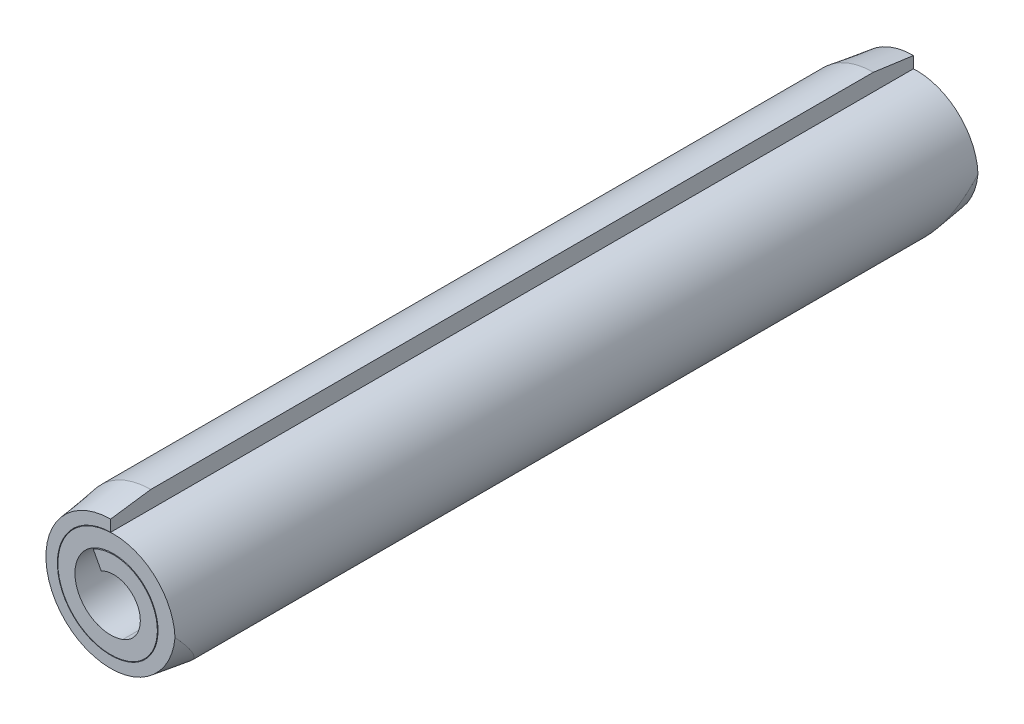
ISO-10303-21;
HEADER;
FILE_DESCRIPTION(('STEP AP214'),'2;1');
FILE_NAME('part.step','',(''),(''),'','','');
FILE_SCHEMA(('AUTOMOTIVE_DESIGN { 1 0 10303 214 1 1 1 1 }'));
ENDSEC;
DATA;
#1=APPLICATION_CONTEXT('core data for automotive mechanical design processes');
#2=APPLICATION_PROTOCOL_DEFINITION('international standard','automotive_design',2000,#1);
#3=PRODUCT_CONTEXT('',#1,'mechanical');
#4=PRODUCT('Part','Part','',(#3));
#5=PRODUCT_RELATED_PRODUCT_CATEGORY('part','',(#4));
#6=PRODUCT_DEFINITION_FORMATION('','',#4);
#7=PRODUCT_DEFINITION_CONTEXT('part definition',#1,'design');
#8=PRODUCT_DEFINITION('design','',#6,#7);
#9=PRODUCT_DEFINITION_SHAPE('','',#8);
#10=(LENGTH_UNIT() NAMED_UNIT(*) SI_UNIT(.MILLI.,.METRE.));
#11=(NAMED_UNIT(*) PLANE_ANGLE_UNIT() SI_UNIT($,.RADIAN.));
#12=(NAMED_UNIT(*) SI_UNIT($,.STERADIAN.) SOLID_ANGLE_UNIT());
#13=UNCERTAINTY_MEASURE_WITH_UNIT(LENGTH_MEASURE(1.E-05),#10,'distance_accuracy_value','');
#14=(GEOMETRIC_REPRESENTATION_CONTEXT(3) GLOBAL_UNCERTAINTY_ASSIGNED_CONTEXT((#13)) GLOBAL_UNIT_ASSIGNED_CONTEXT((#10,
#11,#12)) REPRESENTATION_CONTEXT('',''));
#15=CARTESIAN_POINT('',(0.,0.,0.));
#16=DIRECTION('',(0.,0.,1.));
#17=DIRECTION('',(1.,0.,0.));
#18=AXIS2_PLACEMENT_3D('',#15,#16,#17);
#19=CARTESIAN_POINT('',(-0.211085830625034,0.338291437783564,-9.));
#20=DIRECTION('',(0.883353817881994,0.468706765935062,0.));
#21=DIRECTION('',(-0.468706765935062,0.883353817881994,0.));
#22=AXIS2_PLACEMENT_3D('',#19,#20,#21);
#23=PLANE('',#22);
#24=DIRECTION('',(0.,0.,1.));
#25=VECTOR('',#24,1.);
#26=CARTESIAN_POINT('',(-0.390102521039357,0.675677386600868,-9.));
#27=LINE('',#26,#25);
#28=CARTESIAN_POINT('',(-0.390102521039357,0.675677386600868,-9.));
#29=VERTEX_POINT('',#28);
#30=CARTESIAN_POINT('',(-0.390102521039357,0.675677386600868,9.));
#31=VERTEX_POINT('',#30);
#32=EDGE_CURVE('E241',#29,#31,#27,.T.);
#33=ORIENTED_EDGE('',*,*,#32,.F.);
#34=DIRECTION('',(-0.468706765935062,0.883353817881994,0.));
#35=VECTOR('',#34,1.);
#36=CARTESIAN_POINT('',(-0.211085830625034,0.338291437783564,-9.));
#37=LINE('',#36,#35);
#38=CARTESIAN_POINT('',(-0.211085830625034,0.338291437783564,-9.));
#39=VERTEX_POINT('',#38);
#40=EDGE_CURVE('E126',#39,#29,#37,.T.);
#41=ORIENTED_EDGE('',*,*,#40,.F.);
#42=DIRECTION('',(0.,0.,1.));
#43=VECTOR('',#42,1.);
#44=CARTESIAN_POINT('',(-0.211085830625034,0.338291437783564,-9.));
#45=LINE('',#44,#43);
#46=CARTESIAN_POINT('',(-0.211085830625034,0.338291437783564,9.));
#47=VERTEX_POINT('',#46);
#48=EDGE_CURVE('E110',#47,#39,#45,.F.);
#49=ORIENTED_EDGE('',*,*,#48,.F.);
#50=DIRECTION('',(-0.468706765935062,0.883353817881994,0.));
#51=VECTOR('',#50,1.);
#52=CARTESIAN_POINT('',(-0.211085830625034,0.338291437783564,9.));
#53=LINE('',#52,#51);
#54=EDGE_CURVE('E117',#31,#47,#53,.F.);
#55=ORIENTED_EDGE('',*,*,#54,.F.);
#56=EDGE_LOOP('',(#33,#41,#49,#55));
#57=FACE_BOUND('',#56,.T.);
#58=ADVANCED_FACE('F17',(#57),#23,.F.);
#59=CARTESIAN_POINT('',(0.0689996919525346,-0.189575095588917,-9.));
#60=DIRECTION('',(0.,0.,1.));
#61=DIRECTION('',(1.,0.,0.));
#62=AXIS2_PLACEMENT_3D('',#59,#60,#61);
#63=CYLINDRICAL_SURFACE('',#62,0.597570897059278);
#64=CARTESIAN_POINT('',(0.0689996919525346,-0.189575095588917,-9.));
#65=DIRECTION('',(0.,0.,1.));
#66=DIRECTION('',(1.,0.,0.));
#67=AXIS2_PLACEMENT_3D('',#64,#65,#66);
#68=CIRCLE('',#67,0.597570897059278);
#69=CARTESIAN_POINT('',(0.273380975811996,-0.751108057951937,-9.));
#70=VERTEX_POINT('',#69);
#71=EDGE_CURVE('E102',#70,#39,#68,.T.);
#72=ORIENTED_EDGE('',*,*,#71,.F.);
#73=DIRECTION('',(0.,0.,1.));
#74=VECTOR('',#73,1.);
#75=CARTESIAN_POINT('',(0.273380975811998,-0.751108057951936,-9.));
#76=LINE('',#75,#74);
#77=CARTESIAN_POINT('',(0.273380975811996,-0.751108057951937,9.));
#78=VERTEX_POINT('',#77);
#79=EDGE_CURVE('E113',#70,#78,#76,.T.);
#80=ORIENTED_EDGE('',*,*,#79,.T.);
#81=CARTESIAN_POINT('',(0.0689996919525346,-0.189575095588917,9.));
#82=DIRECTION('',(0.,0.,1.));
#83=DIRECTION('',(1.,0.,0.));
#84=AXIS2_PLACEMENT_3D('',#81,#82,#83);
#85=CIRCLE('',#84,0.597570897059278);
#86=EDGE_CURVE('E20',#47,#78,#85,.F.);
#87=ORIENTED_EDGE('',*,*,#86,.F.);
#88=ORIENTED_EDGE('',*,*,#48,.T.);
#89=EDGE_LOOP('',(#72,#80,#87,#88));
#90=FACE_BOUND('',#89,.T.);
#91=ADVANCED_FACE('F108',(#90),#63,.F.);
#92=CARTESIAN_POINT('',(0.,0.,-9.));
#93=DIRECTION('',(0.,0.,1.));
#94=DIRECTION('',(1.,0.,0.));
#95=AXIS2_PLACEMENT_3D('',#92,#93,#94);
#96=CYLINDRICAL_SURFACE('',#95,1.18125);
#97=CARTESIAN_POINT('',(0.,0.,-9.));
#98=DIRECTION('',(0.,0.,1.));
#99=DIRECTION('',(1.,0.,0.));
#100=AXIS2_PLACEMENT_3D('',#97,#98,#99);
#101=CIRCLE('',#100,1.18125);
#102=CARTESIAN_POINT('',(-0.404011294303447,1.11001190830335,-9.));
#103=VERTEX_POINT('',#102);
#104=CARTESIAN_POINT('',(0.404011294303443,-1.11001190830336,-9.));
#105=VERTEX_POINT('',#104);
#106=EDGE_CURVE('E261',#103,#105,#101,.T.);
#107=ORIENTED_EDGE('',*,*,#106,.T.);
#108=DIRECTION('',(0.,0.,1.));
#109=VECTOR('',#108,1.);
#110=CARTESIAN_POINT('',(0.404011294303446,-1.11001190830335,-9.));
#111=LINE('',#110,#109);
#112=CARTESIAN_POINT('',(0.404011294303443,-1.11001190830336,9.));
#113=VERTEX_POINT('',#112);
#114=EDGE_CURVE('E243',#105,#113,#111,.T.);
#115=ORIENTED_EDGE('',*,*,#114,.T.);
#116=CARTESIAN_POINT('',(0.,0.,9.));
#117=DIRECTION('',(0.,0.,1.));
#118=DIRECTION('',(1.,0.,0.));
#119=AXIS2_PLACEMENT_3D('',#116,#117,#118);
#120=CIRCLE('',#119,1.18125);
#121=CARTESIAN_POINT('',(-0.404011294303447,1.11001190830335,9.));
#122=VERTEX_POINT('',#121);
#123=EDGE_CURVE('E253',#122,#113,#120,.T.);
#124=ORIENTED_EDGE('',*,*,#123,.F.);
#125=DIRECTION('',(0.,0.,1.));
#126=VECTOR('',#125,1.);
#127=CARTESIAN_POINT('',(-0.404011294303447,1.11001190830335,-9.));
#128=LINE('',#127,#126);
#129=EDGE_CURVE('E232',#103,#122,#128,.T.);
#130=ORIENTED_EDGE('',*,*,#129,.F.);
#131=EDGE_LOOP('',(#107,#115,#124,#130));
#132=FACE_BOUND('',#131,.T.);
#133=ADVANCED_FACE('F181',(#132),#96,.T.);
#134=CARTESIAN_POINT('',(0.0689996919525346,-0.189575095588917,-9.));
#135=DIRECTION('',(0.,0.,1.));
#136=DIRECTION('',(1.,0.,0.));
#137=AXIS2_PLACEMENT_3D('',#134,#135,#136);
#138=CYLINDRICAL_SURFACE('',#137,0.979508397059278);
#139=ORIENTED_EDGE('',*,*,#32,.T.);
#140=CARTESIAN_POINT('',(0.0689996919525346,-0.189575095588917,9.));
#141=DIRECTION('',(0.,0.,1.));
#142=DIRECTION('',(1.,0.,0.));
#143=AXIS2_PLACEMENT_3D('',#140,#141,#142);
#144=CIRCLE('',#143,0.979508397059278);
#145=EDGE_CURVE('E122',#113,#31,#144,.T.);
#146=ORIENTED_EDGE('',*,*,#145,.F.);
#147=ORIENTED_EDGE('',*,*,#114,.F.);
#148=CARTESIAN_POINT('',(0.0689996919525346,-0.189575095588917,-9.));
#149=DIRECTION('',(0.,0.,1.));
#150=DIRECTION('',(1.,0.,0.));
#151=AXIS2_PLACEMENT_3D('',#148,#149,#150);
#152=CIRCLE('',#151,0.979508397059278);
#153=EDGE_CURVE('E263',#105,#29,#152,.T.);
#154=ORIENTED_EDGE('',*,*,#153,.T.);
#155=EDGE_LOOP('',(#139,#146,#147,#154));
#156=FACE_BOUND('',#155,.T.);
#157=ADVANCED_FACE('F177',(#156),#138,.T.);
#158=CARTESIAN_POINT('',(0.,0.,-9.));
#159=DIRECTION('',(0.,0.,1.));
#160=DIRECTION('',(1.,0.,0.));
#161=AXIS2_PLACEMENT_3D('',#158,#159,#160);
#162=CYLINDRICAL_SURFACE('',#161,0.799312499999999);
#163=ORIENTED_EDGE('',*,*,#79,.F.);
#164=CARTESIAN_POINT('',(0.,0.,-9.));
#165=DIRECTION('',(0.,0.,1.));
#166=DIRECTION('',(1.,0.,0.));
#167=AXIS2_PLACEMENT_3D('',#164,#165,#166);
#168=CIRCLE('',#167,0.799312499999999);
#169=CARTESIAN_POINT('',(-0.273380975811999,0.751108057951935,-9.));
#170=VERTEX_POINT('',#169);
#171=EDGE_CURVE('E266',#70,#170,#168,.F.);
#172=ORIENTED_EDGE('',*,*,#171,.T.);
#173=DIRECTION('',(0.,0.,1.));
#174=VECTOR('',#173,1.);
#175=CARTESIAN_POINT('',(-0.273380975811999,0.751108057951935,-9.));
#176=LINE('',#175,#174);
#177=CARTESIAN_POINT('',(-0.273380975811999,0.751108057951935,9.));
#178=VERTEX_POINT('',#177);
#179=EDGE_CURVE('E235',#170,#178,#176,.T.);
#180=ORIENTED_EDGE('',*,*,#179,.T.);
#181=CARTESIAN_POINT('',(0.,0.,9.));
#182=DIRECTION('',(0.,0.,1.));
#183=DIRECTION('',(1.,0.,0.));
#184=AXIS2_PLACEMENT_3D('',#181,#182,#183);
#185=CIRCLE('',#184,0.799312499999999);
#186=EDGE_CURVE('E256',#78,#178,#185,.F.);
#187=ORIENTED_EDGE('',*,*,#186,.F.);
#188=EDGE_LOOP('',(#163,#172,#180,#187));
#189=FACE_BOUND('',#188,.T.);
#190=ADVANCED_FACE('F173',(#189),#162,.F.);
#191=CARTESIAN_POINT('',(0.0673352157172413,-0.185001984717226,-9.));
#192=DIRECTION('',(0.,0.,1.));
#193=DIRECTION('',(1.,0.,0.));
#194=AXIS2_PLACEMENT_3D('',#191,#192,#193);
#195=CYLINDRICAL_SURFACE('',#194,0.996187499999999);
#196=CARTESIAN_POINT('',(0.0673352157172413,-0.185001984717226,-9.));
#197=DIRECTION('',(0.,0.,1.));
#198=DIRECTION('',(1.,0.,0.));
#199=AXIS2_PLACEMENT_3D('',#196,#197,#198);
#200=CIRCLE('',#199,0.996187499999999);
#201=CARTESIAN_POINT('',(0.408051407246481,-1.12111202738639,-9.));
#202=VERTEX_POINT('',#201);
#203=EDGE_CURVE('E268',#170,#202,#200,.F.);
#204=ORIENTED_EDGE('',*,*,#203,.T.);
#205=DIRECTION('',(0.,0.,1.));
#206=VECTOR('',#205,1.);
#207=CARTESIAN_POINT('',(0.408051407246481,-1.12111202738639,-9.));
#208=LINE('',#207,#206);
#209=CARTESIAN_POINT('',(0.408051407246481,-1.12111202738639,9.));
#210=VERTEX_POINT('',#209);
#211=EDGE_CURVE('E229',#202,#210,#208,.T.);
#212=ORIENTED_EDGE('',*,*,#211,.T.);
#213=CARTESIAN_POINT('',(0.0673352157172413,-0.185001984717226,9.));
#214=DIRECTION('',(0.,0.,1.));
#215=DIRECTION('',(1.,0.,0.));
#216=AXIS2_PLACEMENT_3D('',#213,#214,#215);
#217=CIRCLE('',#216,0.996187499999999);
#218=EDGE_CURVE('E230',#178,#210,#217,.F.);
#219=ORIENTED_EDGE('',*,*,#218,.F.);
#220=ORIENTED_EDGE('',*,*,#179,.F.);
#221=EDGE_LOOP('',(#204,#212,#219,#220));
#222=FACE_BOUND('',#221,.T.);
#223=ADVANCED_FACE('F170',(#222),#195,.F.);
#224=CARTESIAN_POINT('',(0.0689996919525346,-0.189575095588917,9.));
#225=DIRECTION('',(0.,0.,1.));
#226=DIRECTION('',(1.,0.,0.));
#227=AXIS2_PLACEMENT_3D('',#224,#225,#226);
#228=PLANE('',#227);
#229=CARTESIAN_POINT('',(0.,0.,9.));
#230=DIRECTION('',(0.,0.,1.));
#231=DIRECTION('',(1.,0.,0.));
#232=AXIS2_PLACEMENT_3D('',#229,#230,#231);
#233=CIRCLE('',#232,1.1930625);
#234=CARTESIAN_POINT('',(0.,1.1930625,9.));
#235=VERTEX_POINT('',#234);
#236=EDGE_CURVE('E237',#210,#235,#233,.F.);
#237=ORIENTED_EDGE('',*,*,#236,.T.);
#238=DIRECTION('',(0.,1.,0.));
#239=VECTOR('',#238,1.);
#240=CARTESIAN_POINT('',(0.,-0.189575095588917,9.));
#241=LINE('',#240,#239);
#242=CARTESIAN_POINT('',(0.,1.45000000000275,9.00000000000728));
#243=VERTEX_POINT('',#242);
#244=EDGE_CURVE('E228',#235,#243,#241,.T.);
#245=ORIENTED_EDGE('',*,*,#244,.T.);
#246=CARTESIAN_POINT('',(0.,0.,9.00000000001455));
#247=DIRECTION('',(0.,0.,-1.));
#248=DIRECTION('',(-1.,0.,0.));
#249=AXIS2_PLACEMENT_3D('',#246,#247,#248);
#250=CIRCLE('',#249,1.4500000000055);
#251=CARTESIAN_POINT('',(1.44429938850018,-0.12844950911095,8.99999999999959));
#252=VERTEX_POINT('',#251);
#253=EDGE_CURVE('E135',#252,#243,#250,.T.);
#254=ORIENTED_EDGE('',*,*,#253,.F.);
#255=CARTESIAN_POINT('',(0.0673352157172413,-0.185001984717226,9.));
#256=DIRECTION('',(0.,0.,1.));
#257=DIRECTION('',(1.,0.,0.));
#258=AXIS2_PLACEMENT_3D('',#255,#256,#257);
#259=CIRCLE('',#258,1.378125);
#260=EDGE_CURVE('E234',#252,#122,#259,.T.);
#261=ORIENTED_EDGE('',*,*,#260,.T.);
#262=ORIENTED_EDGE('',*,*,#123,.T.);
#263=ORIENTED_EDGE('',*,*,#145,.T.);
#264=ORIENTED_EDGE('',*,*,#54,.T.);
#265=ORIENTED_EDGE('',*,*,#86,.T.);
#266=ORIENTED_EDGE('',*,*,#186,.T.);
#267=ORIENTED_EDGE('',*,*,#218,.T.);
#268=EDGE_LOOP('',(#237,#245,#254,#261,#262,#263,#264,#265,#266,#267));
#269=FACE_BOUND('',#268,.T.);
#270=ADVANCED_FACE('F120',(#269),#228,.T.);
#271=CARTESIAN_POINT('',(0.,0.,-9.));
#272=DIRECTION('',(0.,0.,1.));
#273=DIRECTION('',(1.,0.,0.));
#274=AXIS2_PLACEMENT_3D('',#271,#272,#273);
#275=CYLINDRICAL_SURFACE('',#274,1.1930625);
#276=ORIENTED_EDGE('',*,*,#211,.F.);
#277=CARTESIAN_POINT('',(0.,0.,-9.));
#278=DIRECTION('',(0.,0.,1.));
#279=DIRECTION('',(1.,0.,0.));
#280=AXIS2_PLACEMENT_3D('',#277,#278,#279);
#281=CIRCLE('',#280,1.1930625);
#282=CARTESIAN_POINT('',(0.,1.1930625,-9.));
#283=VERTEX_POINT('',#282);
#284=EDGE_CURVE('E270',#202,#283,#281,.F.);
#285=ORIENTED_EDGE('',*,*,#284,.T.);
#286=DIRECTION('',(0.,0.,1.));
#287=VECTOR('',#286,1.);
#288=CARTESIAN_POINT('',(0.,1.1930625,-9.));
#289=LINE('',#288,#287);
#290=EDGE_CURVE('E138',#283,#235,#289,.T.);
#291=ORIENTED_EDGE('',*,*,#290,.T.);
#292=ORIENTED_EDGE('',*,*,#236,.F.);
#293=EDGE_LOOP('',(#276,#285,#291,#292));
#294=FACE_BOUND('',#293,.T.);
#295=ADVANCED_FACE('F164',(#294),#275,.F.);
#296=CARTESIAN_POINT('',(0.0689996919525346,-0.189575095588917,-9.));
#297=DIRECTION('',(0.,0.,1.));
#298=DIRECTION('',(1.,0.,0.));
#299=AXIS2_PLACEMENT_3D('',#296,#297,#298);
#300=PLANE('',#299);
#301=CARTESIAN_POINT('',(0.0673352157172413,-0.185001984717226,-9.));
#302=DIRECTION('',(0.,0.,1.));
#303=DIRECTION('',(1.,0.,0.));
#304=AXIS2_PLACEMENT_3D('',#301,#302,#303);
#305=CIRCLE('',#304,1.378125);
#306=CARTESIAN_POINT('',(1.4442993884941,-0.128449509048925,-8.99999999999183));
#307=VERTEX_POINT('',#306);
#308=EDGE_CURVE('E271',#307,#103,#305,.T.);
#309=ORIENTED_EDGE('',*,*,#308,.F.);
#310=CARTESIAN_POINT('',(0.,0.,-9.00000000000728));
#311=DIRECTION('',(0.,0.,1.));
#312=DIRECTION('',(1.,0.,0.));
#313=AXIS2_PLACEMENT_3D('',#310,#311,#312);
#314=CIRCLE('',#313,1.44999999999388);
#315=CARTESIAN_POINT('',(0.,1.44999999999827,-9.0000000000357));
#316=VERTEX_POINT('',#315);
#317=EDGE_CURVE('E131',#316,#307,#314,.T.);
#318=ORIENTED_EDGE('',*,*,#317,.F.);
#319=DIRECTION('',(0.,-1.,0.));
#320=VECTOR('',#319,1.);
#321=CARTESIAN_POINT('',(0.,1.575,-9.));
#322=LINE('',#321,#320);
#323=EDGE_CURVE('E134',#316,#283,#322,.T.);
#324=ORIENTED_EDGE('',*,*,#323,.T.);
#325=ORIENTED_EDGE('',*,*,#284,.F.);
#326=ORIENTED_EDGE('',*,*,#203,.F.);
#327=ORIENTED_EDGE('',*,*,#171,.F.);
#328=ORIENTED_EDGE('',*,*,#71,.T.);
#329=ORIENTED_EDGE('',*,*,#40,.T.);
#330=ORIENTED_EDGE('',*,*,#153,.F.);
#331=ORIENTED_EDGE('',*,*,#106,.F.);
#332=EDGE_LOOP('',(#309,#318,#324,#325,#326,#327,#328,#329,#330,#331));
#333=FACE_BOUND('',#332,.T.);
#334=ADVANCED_FACE('F159',(#333),#300,.F.);
#335=CARTESIAN_POINT('',(0.0673352157172413,-0.185001984717226,-9.));
#336=DIRECTION('',(0.,0.,1.));
#337=DIRECTION('',(1.,0.,0.));
#338=AXIS2_PLACEMENT_3D('',#335,#336,#337);
#339=CYLINDRICAL_SURFACE('',#338,1.378125);
#340=CARTESIAN_POINT('',(0.538681725737929,-1.4800158777378,8.10000000013377));
#341=CARTESIAN_POINT('',(0.568457575291803,-1.46918224784146,8.09999713101628));
#342=CARTESIAN_POINT('',(0.597839499243149,-1.45732031822733,8.10098429130596));
#343=CARTESIAN_POINT('',(0.655594090129832,-1.43166818089949,8.10490183378926));
#344=CARTESIAN_POINT('',(0.683967372478445,-1.41787917521204,8.10783100887027));
#345=CARTESIAN_POINT('',(0.766848538637026,-1.3740290993974,8.11941549407509));
#346=CARTESIAN_POINT('',(0.819605068856571,-1.341305849971,8.13086913587589));
#347=CARTESIAN_POINT('',(0.91886350255145,-1.27029254251756,8.16049297442889));
#348=CARTESIAN_POINT('',(0.96537807650679,-1.23201410026104,8.17864927546407));
#349=CARTESIAN_POINT('',(1.05175685498751,-1.15125624233099,8.22072898540391));
#350=CARTESIAN_POINT('',(1.09160909000056,-1.10876947946312,8.24466258924759));
#351=CARTESIAN_POINT('',(1.17710475141354,-1.00570152050876,8.30644462732102));
#352=CARTESIAN_POINT('',(1.21994637778338,-0.943964007703288,8.34623810526463));
#353=CARTESIAN_POINT('',(1.29370887157189,-0.817925509819062,8.43232155733951));
#354=CARTESIAN_POINT('',(1.32460475054872,-0.753619458310551,8.47862487616102));
#355=CARTESIAN_POINT('',(1.38325770469748,-0.604341069078676,8.59105648021862));
#356=CARTESIAN_POINT('',(1.40709324711908,-0.519124290582799,8.65888893123065));
#357=CARTESIAN_POINT('',(1.43818930890035,-0.350375391470358,8.79985561180811));
#358=CARTESIAN_POINT('',(1.44546431248168,-0.266841862084883,8.8729851506042));
#359=CARTESIAN_POINT('',(1.44545926734968,-0.166056720468179,8.96510866235372));
#360=CARTESIAN_POINT('',(1.4450682430972,-0.147202216422362,8.98251560369966));
#361=CARTESIAN_POINT('',(1.44429938849984,-0.128449509102625,9.00000000003007));
#362=B_SPLINE_CURVE_WITH_KNOTS('',3,(#340,#341,#342,#343,#344,#345,#346,#347,#348,#349,#350,
#351,#352,#353,#354,#355,#356,#357,#358,#359,#360,#361),.UNSPECIFIED.,.F.,.F.,(4,2,2,2,2,2,2,2,
2,2,4),(0.,0.0949867724274584,0.189914558504254,0.378235945696181,0.566169084306071,
0.754436315914468,1.00814215783727,1.26237587384423,1.59518693674558,1.92770680354278,
2.00468244131286),.UNSPECIFIED.);
#363=CARTESIAN_POINT('',(0.538681725737929,-1.48001587773781,8.10000000006688));
#364=VERTEX_POINT('',#363);
#365=EDGE_CURVE('E139',#364,#252,#362,.T.);
#366=ORIENTED_EDGE('',*,*,#365,.F.);
#367=DIRECTION('',(0.,0.,1.));
#368=VECTOR('',#367,1.);
#369=CARTESIAN_POINT('',(0.538681725737929,-1.48001587773781,-9.));
#370=LINE('',#369,#368);
#371=CARTESIAN_POINT('',(0.538681725738364,-1.480015877739,-8.10000000000521));
#372=VERTEX_POINT('',#371);
#373=EDGE_CURVE('E219',#372,#364,#370,.T.);
#374=ORIENTED_EDGE('',*,*,#373,.F.);
#375=CARTESIAN_POINT('',(0.538681725737928,-1.4800158777378,-8.09999999999733));
#376=CARTESIAN_POINT('',(0.568457575291395,-1.46918224784161,-8.09999713087984));
#377=CARTESIAN_POINT('',(0.597839499242344,-1.45732031822765,-8.10098429116955));
#378=CARTESIAN_POINT('',(0.65559409012825,-1.43166818090023,-8.10490183365294));
#379=CARTESIAN_POINT('',(0.683967372476484,-1.41787917521301,-8.10783100873402));
#380=CARTESIAN_POINT('',(0.766848538633942,-1.37402909939916,-8.11941549393909));
#381=CARTESIAN_POINT('',(0.819605068852773,-1.34130584997342,-8.13086913574014));
#382=CARTESIAN_POINT('',(0.918863502546322,-1.27029254252153,-8.16049297429373));
#383=CARTESIAN_POINT('',(0.965378076501044,-1.23201410026591,-8.17864927532924));
#384=CARTESIAN_POINT('',(1.05175685498068,-1.15125624233788,-8.22072898526982));
#385=CARTESIAN_POINT('',(1.09160908999328,-1.10876947947113,-8.24466258911388));
#386=CARTESIAN_POINT('',(1.17710475140619,-1.00570152051867,-8.30644462718879));
#387=CARTESIAN_POINT('',(1.21994637777631,-0.94396400771397,-8.34623810513363));
#388=CARTESIAN_POINT('',(1.29370887156546,-0.817925509831453,-8.43232155721112));
#389=CARTESIAN_POINT('',(1.32460475054265,-0.753619458323878,-8.478624876034));
#390=CARTESIAN_POINT('',(1.38325770469693,-0.604341069082856,-8.59105648010344));
#391=CARTESIAN_POINT('',(1.40709324712121,-0.519124290576775,-8.65888893112708));
#392=CARTESIAN_POINT('',(1.43818930890405,-0.350375391444716,-8.79985561172889));
#393=CARTESIAN_POINT('',(1.44546431248429,-0.266841862049826,-8.87298515053772));
#394=CARTESIAN_POINT('',(1.44545926734907,-0.166056720423758,-8.96510866230187));
#395=CARTESIAN_POINT('',(1.44506824309597,-0.147202216377404,-8.98251560364947));
#396=CARTESIAN_POINT('',(1.44429938849797,-0.128449509057147,-8.99999999998152));
#397=B_SPLINE_CURVE_WITH_KNOTS('',3,(#375,#376,#377,#378,#379,#380,#381,#382,#383,#384,#385,
#386,#387,#388,#389,#390,#391,#392,#393,#394,#395,#396),.UNSPECIFIED.,.F.,.F.,(4,2,2,2,2,2,2,2,
2,2,4),(0.,0.0949867724261565,0.189914558501646,0.378235945690907,0.566169084298099,
0.754436315903807,1.00814215782707,1.26237587383457,1.59518693678158,1.92770680362454,
2.00468244139919),.UNSPECIFIED.);
#398=EDGE_CURVE('E146',#372,#307,#397,.T.);
#399=ORIENTED_EDGE('',*,*,#398,.T.);
#400=ORIENTED_EDGE('',*,*,#308,.T.);
#401=ORIENTED_EDGE('',*,*,#129,.T.);
#402=ORIENTED_EDGE('',*,*,#260,.F.);
#403=EDGE_LOOP('',(#366,#374,#399,#400,#401,#402));
#404=FACE_BOUND('',#403,.T.);
#405=ADVANCED_FACE('F155',(#404),#339,.T.);
#406=CARTESIAN_POINT('',(0.,0.,8.1000000000131));
#407=DIRECTION('',(0.,0.,-1.));
#408=DIRECTION('',(-1.,0.,0.));
#409=AXIS2_PLACEMENT_3D('',#406,#407,#408);
#410=CONICAL_SURFACE('',#409,1.57500000001676,0.138006023669568);
#411=DIRECTION('',(0.,0.137568371274688,-0.990492273177751));
#412=VECTOR('',#411,1.);
#413=CARTESIAN_POINT('',(0.,1.45,9.));
#414=LINE('',#413,#412);
#415=CARTESIAN_POINT('',(0.,1.57500000000838,8.10000000000656));
#416=VERTEX_POINT('',#415);
#417=EDGE_CURVE('E211',#243,#416,#414,.T.);
#418=ORIENTED_EDGE('',*,*,#417,.T.);
#419=CARTESIAN_POINT('',(0.,0.,8.1));
#420=DIRECTION('',(0.,0.,1.));
#421=DIRECTION('',(1.,0.,0.));
#422=AXIS2_PLACEMENT_3D('',#419,#420,#421);
#423=CIRCLE('',#422,1.575);
#424=EDGE_CURVE('E213',#364,#416,#423,.F.);
#425=ORIENTED_EDGE('',*,*,#424,.F.);
#426=ORIENTED_EDGE('',*,*,#365,.T.);
#427=ORIENTED_EDGE('',*,*,#253,.T.);
#428=EDGE_LOOP('',(#418,#425,#426,#427));
#429=FACE_BOUND('',#428,.T.);
#430=ADVANCED_FACE('F152',(#429),#410,.T.);
#431=CARTESIAN_POINT('',(0.,1.575,-9.));
#432=DIRECTION('',(-1.,0.,0.));
#433=DIRECTION('',(0.,-1.,0.));
#434=AXIS2_PLACEMENT_3D('',#431,#432,#433);
#435=PLANE('',#434);
#436=DIRECTION('',(0.,-0.137568371274689,-0.990492273177752));
#437=VECTOR('',#436,1.);
#438=CARTESIAN_POINT('',(8.48781333205985E-12,69308.255555556,499000.));
#439=LINE('',#438,#437);
#440=CARTESIAN_POINT('',(0.,1.57500000000419,-8.10000000000328));
#441=VERTEX_POINT('',#440);
#442=EDGE_CURVE('E35',#441,#316,#439,.T.);
#443=ORIENTED_EDGE('',*,*,#442,.F.);
#444=DIRECTION('',(0.,0.,1.));
#445=VECTOR('',#444,1.);
#446=CARTESIAN_POINT('',(0.,1.575,-9.));
#447=LINE('',#446,#445);
#448=EDGE_CURVE('E26',#416,#441,#447,.F.);
#449=ORIENTED_EDGE('',*,*,#448,.F.);
#450=ORIENTED_EDGE('',*,*,#417,.F.);
#451=ORIENTED_EDGE('',*,*,#244,.F.);
#452=ORIENTED_EDGE('',*,*,#290,.F.);
#453=ORIENTED_EDGE('',*,*,#323,.F.);
#454=EDGE_LOOP('',(#443,#449,#450,#451,#452,#453));
#455=FACE_BOUND('',#454,.T.);
#456=ADVANCED_FACE('F198',(#455),#435,.F.);
#457=CARTESIAN_POINT('',(0.,0.,-8.10000000018363));
#458=DIRECTION('',(0.,0.,1.));
#459=DIRECTION('',(1.,0.,0.));
#460=AXIS2_PLACEMENT_3D('',#457,#458,#459);
#461=CONICAL_SURFACE('',#460,1.57499999997413,0.138006023662683);
#462=CARTESIAN_POINT('',(0.,0.,-8.1));
#463=DIRECTION('',(0.,0.,1.));
#464=DIRECTION('',(1.,0.,0.));
#465=AXIS2_PLACEMENT_3D('',#462,#463,#464);
#466=CIRCLE('',#465,1.575);
#467=EDGE_CURVE('E11',#441,#372,#466,.T.);
#468=ORIENTED_EDGE('',*,*,#467,.F.);
#469=ORIENTED_EDGE('',*,*,#442,.T.);
#470=ORIENTED_EDGE('',*,*,#317,.T.);
#471=ORIENTED_EDGE('',*,*,#398,.F.);
#472=EDGE_LOOP('',(#468,#469,#470,#471));
#473=FACE_BOUND('',#472,.T.);
#474=ADVANCED_FACE('F192',(#473),#461,.T.);
#475=CARTESIAN_POINT('',(0.,0.,-9.));
#476=DIRECTION('',(0.,0.,1.));
#477=DIRECTION('',(1.,0.,0.));
#478=AXIS2_PLACEMENT_3D('',#475,#476,#477);
#479=CYLINDRICAL_SURFACE('',#478,1.575);
#480=ORIENTED_EDGE('',*,*,#448,.T.);
#481=ORIENTED_EDGE('',*,*,#467,.T.);
#482=ORIENTED_EDGE('',*,*,#373,.T.);
#483=ORIENTED_EDGE('',*,*,#424,.T.);
#484=EDGE_LOOP('',(#480,#481,#482,#483));
#485=FACE_BOUND('',#484,.T.);
#486=ADVANCED_FACE('F190',(#485),#479,.T.);
#487=CLOSED_SHELL('',(#58,#91,#133,#157,#190,#223,#270,#295,#334,#405,#430,#456,#474,#486));
#488=MANIFOLD_SOLID_BREP('B1',#487);
#489=ADVANCED_BREP_SHAPE_REPRESENTATION('',(#18,#488),#14);
#490=SHAPE_DEFINITION_REPRESENTATION(#9,#489);
ENDSEC;
END-ISO-10303-21;
